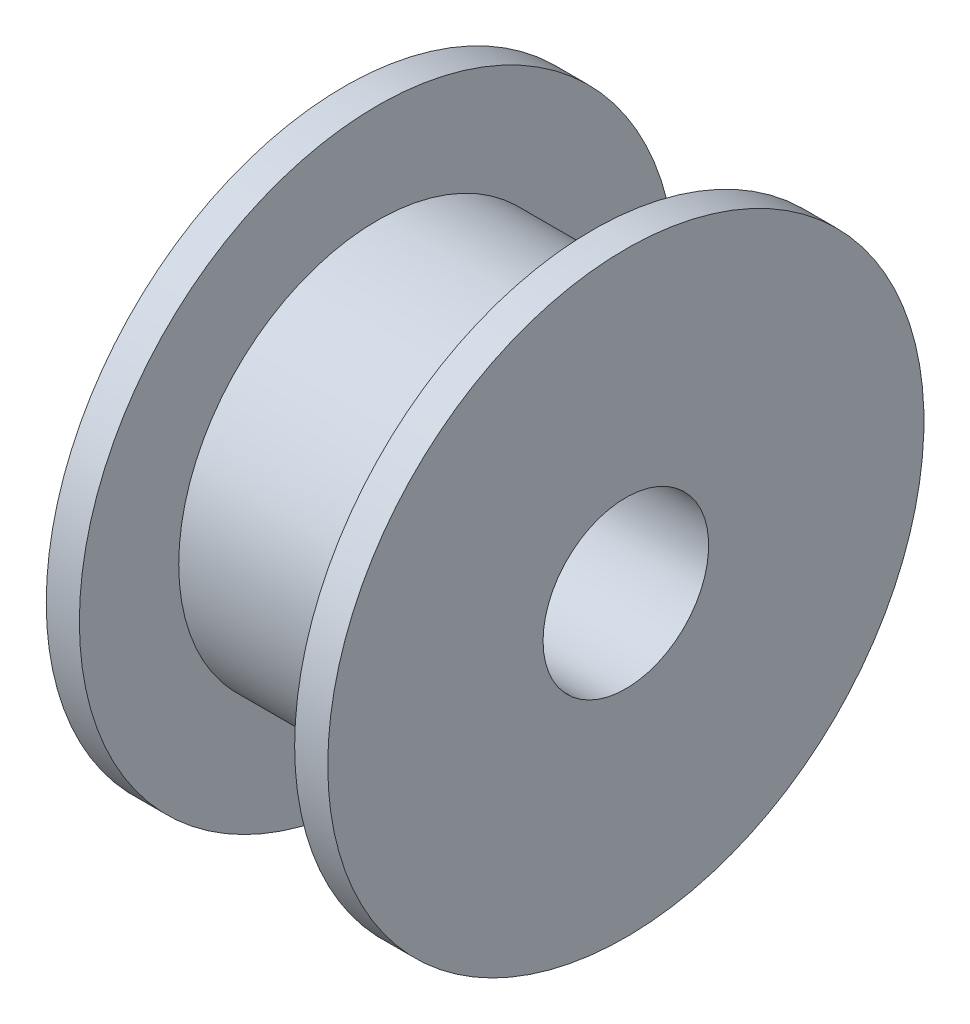
ISO-10303-21;
HEADER;
FILE_DESCRIPTION(('STEP AP214'),'2;1');
FILE_NAME('part.step','',(''),(''),'','','');
FILE_SCHEMA(('AUTOMOTIVE_DESIGN { 1 0 10303 214 1 1 1 1 }'));
ENDSEC;
DATA;
#1=APPLICATION_CONTEXT('core data for automotive mechanical design processes');
#2=APPLICATION_PROTOCOL_DEFINITION('international standard','automotive_design',2000,#1);
#3=PRODUCT_CONTEXT('',#1,'mechanical');
#4=PRODUCT('Part','Part','',(#3));
#5=PRODUCT_RELATED_PRODUCT_CATEGORY('part','',(#4));
#6=PRODUCT_DEFINITION_FORMATION('','',#4);
#7=PRODUCT_DEFINITION_CONTEXT('part definition',#1,'design');
#8=PRODUCT_DEFINITION('design','',#6,#7);
#9=PRODUCT_DEFINITION_SHAPE('','',#8);
#10=(LENGTH_UNIT() NAMED_UNIT(*) SI_UNIT(.MILLI.,.METRE.));
#11=(NAMED_UNIT(*) PLANE_ANGLE_UNIT() SI_UNIT($,.RADIAN.));
#12=(NAMED_UNIT(*) SI_UNIT($,.STERADIAN.) SOLID_ANGLE_UNIT());
#13=UNCERTAINTY_MEASURE_WITH_UNIT(LENGTH_MEASURE(1.E-05),#10,'distance_accuracy_value','');
#14=(GEOMETRIC_REPRESENTATION_CONTEXT(3) GLOBAL_UNCERTAINTY_ASSIGNED_CONTEXT((#13)) GLOBAL_UNIT_ASSIGNED_CONTEXT((#10,
#11,#12)) REPRESENTATION_CONTEXT('',''));
#15=CARTESIAN_POINT('',(0.,0.,0.));
#16=DIRECTION('',(0.,0.,1.));
#17=DIRECTION('',(1.,0.,0.));
#18=AXIS2_PLACEMENT_3D('',#15,#16,#17);
#19=CARTESIAN_POINT('',(0.,0.,0.));
#20=DIRECTION('',(1.,0.,0.));
#21=DIRECTION('',(0.,0.,-1.));
#22=AXIS2_PLACEMENT_3D('',#19,#20,#21);
#23=PLANE('',#22);
#24=CARTESIAN_POINT('',(0.,0.,0.));
#25=DIRECTION('',(-1.,0.,0.));
#26=DIRECTION('',(0.,0.,1.));
#27=AXIS2_PLACEMENT_3D('',#24,#25,#26);
#28=CIRCLE('',#27,2.5);
#29=CARTESIAN_POINT('',(0.,0.,2.5));
#30=VERTEX_POINT('',#29);
#31=EDGE_CURVE('E63',#30,#30,#28,.T.);
#32=ORIENTED_EDGE('',*,*,#31,.F.);
#33=EDGE_LOOP('',(#32));
#34=FACE_BOUND('',#33,.T.);
#35=CARTESIAN_POINT('',(0.,0.,0.));
#36=DIRECTION('',(-1.,0.,0.));
#37=DIRECTION('',(0.,0.,1.));
#38=AXIS2_PLACEMENT_3D('',#35,#36,#37);
#39=CIRCLE('',#38,9.);
#40=CARTESIAN_POINT('',(0.,0.,9.));
#41=VERTEX_POINT('',#40);
#42=EDGE_CURVE('E10',#41,#41,#39,.T.);
#43=ORIENTED_EDGE('',*,*,#42,.T.);
#44=EDGE_LOOP('',(#43));
#45=FACE_BOUND('',#44,.T.);
#46=ADVANCED_FACE('F37',(#34,#45),#23,.F.);
#47=CARTESIAN_POINT('',(0.,0.,0.));
#48=DIRECTION('',(-1.,0.,0.));
#49=DIRECTION('',(0.,0.,1.));
#50=AXIS2_PLACEMENT_3D('',#47,#48,#49);
#51=CYLINDRICAL_SURFACE('',#50,9.);
#52=ORIENTED_EDGE('',*,*,#42,.F.);
#53=EDGE_LOOP('',(#52));
#54=FACE_BOUND('',#53,.T.);
#55=CARTESIAN_POINT('',(1.,0.,0.));
#56=DIRECTION('',(-1.,0.,0.));
#57=DIRECTION('',(0.,0.,1.));
#58=AXIS2_PLACEMENT_3D('',#55,#56,#57);
#59=CIRCLE('',#58,9.);
#60=CARTESIAN_POINT('',(1.,0.,9.));
#61=VERTEX_POINT('',#60);
#62=EDGE_CURVE('E43',#61,#61,#59,.T.);
#63=ORIENTED_EDGE('',*,*,#62,.T.);
#64=EDGE_LOOP('',(#63));
#65=FACE_BOUND('',#64,.T.);
#66=ADVANCED_FACE('F79',(#54,#65),#51,.T.);
#67=CARTESIAN_POINT('',(1.,9.,0.));
#68=DIRECTION('',(-1.,0.,0.));
#69=DIRECTION('',(0.,0.,1.));
#70=AXIS2_PLACEMENT_3D('',#67,#68,#69);
#71=PLANE('',#70);
#72=ORIENTED_EDGE('',*,*,#62,.F.);
#73=EDGE_LOOP('',(#72));
#74=FACE_BOUND('',#73,.T.);
#75=CARTESIAN_POINT('',(1.,0.,0.));
#76=DIRECTION('',(-1.,0.,0.));
#77=DIRECTION('',(0.,0.,1.));
#78=AXIS2_PLACEMENT_3D('',#75,#76,#77);
#79=CIRCLE('',#78,6.);
#80=CARTESIAN_POINT('',(1.,0.,6.));
#81=VERTEX_POINT('',#80);
#82=EDGE_CURVE('E47',#81,#81,#79,.T.);
#83=ORIENTED_EDGE('',*,*,#82,.T.);
#84=EDGE_LOOP('',(#83));
#85=FACE_BOUND('',#84,.T.);
#86=ADVANCED_FACE('F85',(#74,#85),#71,.F.);
#87=CARTESIAN_POINT('',(0.,0.,0.));
#88=DIRECTION('',(-1.,0.,0.));
#89=DIRECTION('',(0.,0.,1.));
#90=AXIS2_PLACEMENT_3D('',#87,#88,#89);
#91=CYLINDRICAL_SURFACE('',#90,6.);
#92=ORIENTED_EDGE('',*,*,#82,.F.);
#93=EDGE_LOOP('',(#92));
#94=FACE_BOUND('',#93,.T.);
#95=CARTESIAN_POINT('',(7.5,0.,0.));
#96=DIRECTION('',(-1.,0.,0.));
#97=DIRECTION('',(0.,0.,1.));
#98=AXIS2_PLACEMENT_3D('',#95,#96,#97);
#99=CIRCLE('',#98,6.);
#100=CARTESIAN_POINT('',(7.5,0.,6.));
#101=VERTEX_POINT('',#100);
#102=EDGE_CURVE('E51',#101,#101,#99,.T.);
#103=ORIENTED_EDGE('',*,*,#102,.T.);
#104=EDGE_LOOP('',(#103));
#105=FACE_BOUND('',#104,.T.);
#106=ADVANCED_FACE('F90',(#94,#105),#91,.T.);
#107=CARTESIAN_POINT('',(7.5,6.,0.));
#108=DIRECTION('',(1.,0.,0.));
#109=DIRECTION('',(0.,0.,-1.));
#110=AXIS2_PLACEMENT_3D('',#107,#108,#109);
#111=PLANE('',#110);
#112=ORIENTED_EDGE('',*,*,#102,.F.);
#113=EDGE_LOOP('',(#112));
#114=FACE_BOUND('',#113,.T.);
#115=CARTESIAN_POINT('',(7.5,0.,0.));
#116=DIRECTION('',(-1.,0.,0.));
#117=DIRECTION('',(0.,0.,1.));
#118=AXIS2_PLACEMENT_3D('',#115,#116,#117);
#119=CIRCLE('',#118,9.);
#120=CARTESIAN_POINT('',(7.5,0.,9.));
#121=VERTEX_POINT('',#120);
#122=EDGE_CURVE('E56',#121,#121,#119,.T.);
#123=ORIENTED_EDGE('',*,*,#122,.T.);
#124=EDGE_LOOP('',(#123));
#125=FACE_BOUND('',#124,.T.);
#126=ADVANCED_FACE('F96',(#114,#125),#111,.F.);
#127=CARTESIAN_POINT('',(0.,0.,0.));
#128=DIRECTION('',(-1.,0.,0.));
#129=DIRECTION('',(0.,0.,1.));
#130=AXIS2_PLACEMENT_3D('',#127,#128,#129);
#131=CYLINDRICAL_SURFACE('',#130,9.);
#132=ORIENTED_EDGE('',*,*,#122,.F.);
#133=EDGE_LOOP('',(#132));
#134=FACE_BOUND('',#133,.T.);
#135=CARTESIAN_POINT('',(8.5,0.,0.));
#136=DIRECTION('',(-1.,0.,0.));
#137=DIRECTION('',(0.,0.,1.));
#138=AXIS2_PLACEMENT_3D('',#135,#136,#137);
#139=CIRCLE('',#138,9.);
#140=CARTESIAN_POINT('',(8.5,0.,9.));
#141=VERTEX_POINT('',#140);
#142=EDGE_CURVE('E59',#141,#141,#139,.T.);
#143=ORIENTED_EDGE('',*,*,#142,.T.);
#144=EDGE_LOOP('',(#143));
#145=FACE_BOUND('',#144,.T.);
#146=ADVANCED_FACE('F100',(#134,#145),#131,.T.);
#147=CARTESIAN_POINT('',(8.5,9.,0.));
#148=DIRECTION('',(-1.,0.,0.));
#149=DIRECTION('',(0.,0.,1.));
#150=AXIS2_PLACEMENT_3D('',#147,#148,#149);
#151=PLANE('',#150);
#152=CARTESIAN_POINT('',(8.5,0.,0.));
#153=DIRECTION('',(-1.,0.,0.));
#154=DIRECTION('',(0.,0.,1.));
#155=AXIS2_PLACEMENT_3D('',#152,#153,#154);
#156=CIRCLE('',#155,2.5);
#157=CARTESIAN_POINT('',(8.5,0.,2.5));
#158=VERTEX_POINT('',#157);
#159=EDGE_CURVE('E62',#158,#158,#156,.T.);
#160=ORIENTED_EDGE('',*,*,#159,.T.);
#161=EDGE_LOOP('',(#160));
#162=FACE_BOUND('',#161,.T.);
#163=ORIENTED_EDGE('',*,*,#142,.F.);
#164=EDGE_LOOP('',(#163));
#165=FACE_BOUND('',#164,.T.);
#166=ADVANCED_FACE('F69',(#162,#165),#151,.F.);
#167=CARTESIAN_POINT('',(8.5,0.,0.));
#168=DIRECTION('',(-1.,0.,0.));
#169=DIRECTION('',(0.,0.,1.));
#170=AXIS2_PLACEMENT_3D('',#167,#168,#169);
#171=CYLINDRICAL_SURFACE('',#170,2.5);
#172=ORIENTED_EDGE('',*,*,#159,.F.);
#173=EDGE_LOOP('',(#172));
#174=FACE_BOUND('',#173,.T.);
#175=ORIENTED_EDGE('',*,*,#31,.T.);
#176=EDGE_LOOP('',(#175));
#177=FACE_BOUND('',#176,.T.);
#178=ADVANCED_FACE('F72',(#174,#177),#171,.F.);
#179=CLOSED_SHELL('',(#46,#66,#86,#106,#126,#146,#166,#178));
#180=MANIFOLD_SOLID_BREP('B2',#179);
#181=ADVANCED_BREP_SHAPE_REPRESENTATION('',(#18,#180),#14);
#182=SHAPE_DEFINITION_REPRESENTATION(#9,#181);
ENDSEC;
END-ISO-10303-21;
